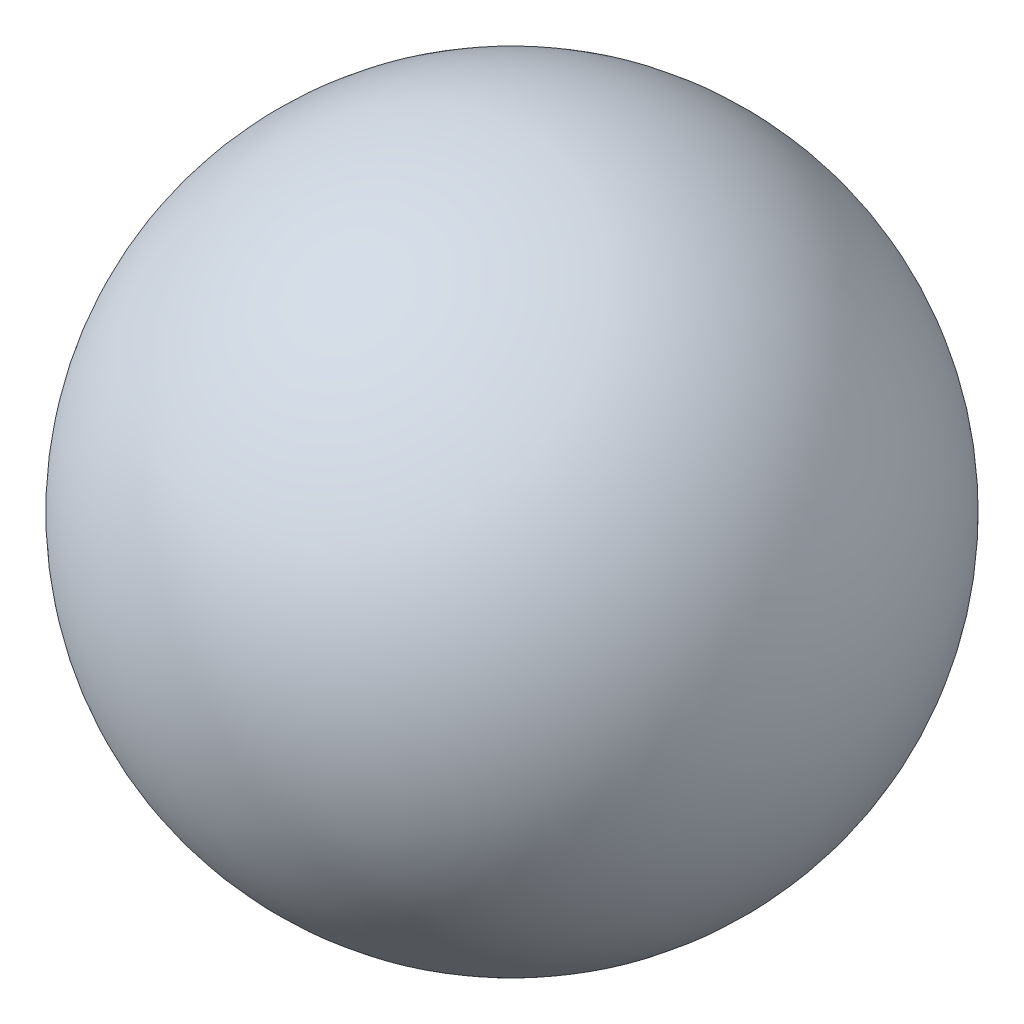
ISO-10303-21;
HEADER;
FILE_DESCRIPTION(('STEP AP214'),'2;1');
FILE_NAME('part.step','',(''),(''),'','','');
FILE_SCHEMA(('AUTOMOTIVE_DESIGN { 1 0 10303 214 1 1 1 1 }'));
ENDSEC;
DATA;
#1=APPLICATION_CONTEXT('core data for automotive mechanical design processes');
#2=APPLICATION_PROTOCOL_DEFINITION('international standard','automotive_design',2000,#1);
#3=PRODUCT_CONTEXT('',#1,'mechanical');
#4=PRODUCT('Part','Part','',(#3));
#5=PRODUCT_RELATED_PRODUCT_CATEGORY('part','',(#4));
#6=PRODUCT_DEFINITION_FORMATION('','',#4);
#7=PRODUCT_DEFINITION_CONTEXT('part definition',#1,'design');
#8=PRODUCT_DEFINITION('design','',#6,#7);
#9=PRODUCT_DEFINITION_SHAPE('','',#8);
#10=(LENGTH_UNIT() NAMED_UNIT(*) SI_UNIT(.MILLI.,.METRE.));
#11=(NAMED_UNIT(*) PLANE_ANGLE_UNIT() SI_UNIT($,.RADIAN.));
#12=(NAMED_UNIT(*) SI_UNIT($,.STERADIAN.) SOLID_ANGLE_UNIT());
#13=UNCERTAINTY_MEASURE_WITH_UNIT(LENGTH_MEASURE(1.E-05),#10,'distance_accuracy_value','');
#14=(GEOMETRIC_REPRESENTATION_CONTEXT(3) GLOBAL_UNCERTAINTY_ASSIGNED_CONTEXT((#13)) GLOBAL_UNIT_ASSIGNED_CONTEXT((#10,
#11,#12)) REPRESENTATION_CONTEXT('',''));
#15=CARTESIAN_POINT('',(0.,0.,0.));
#16=DIRECTION('',(0.,0.,1.));
#17=DIRECTION('',(1.,0.,0.));
#18=AXIS2_PLACEMENT_3D('',#15,#16,#17);
#19=CARTESIAN_POINT('',(0.,0.,0.));
#20=DIRECTION('',(0.,-1.,0.));
#21=DIRECTION('',(1.,0.,0.));
#22=AXIS2_PLACEMENT_3D('',#19,#20,#21);
#23=SPHERICAL_SURFACE('',#22,22.);
#24=CARTESIAN_POINT('',(0.,-22.,0.));
#25=VERTEX_POINT('',#24);
#26=VERTEX_LOOP('',#25);
#27=FACE_BOUND('',#26,.T.);
#28=ADVANCED_FACE('F29',(#27),#23,.T.);
#29=CLOSED_SHELL('',(#28));
#30=MANIFOLD_SOLID_BREP('B2',#29);
#31=ADVANCED_BREP_SHAPE_REPRESENTATION('',(#18,#30),#14);
#32=SHAPE_DEFINITION_REPRESENTATION(#9,#31);
ENDSEC;
END-ISO-10303-21;
